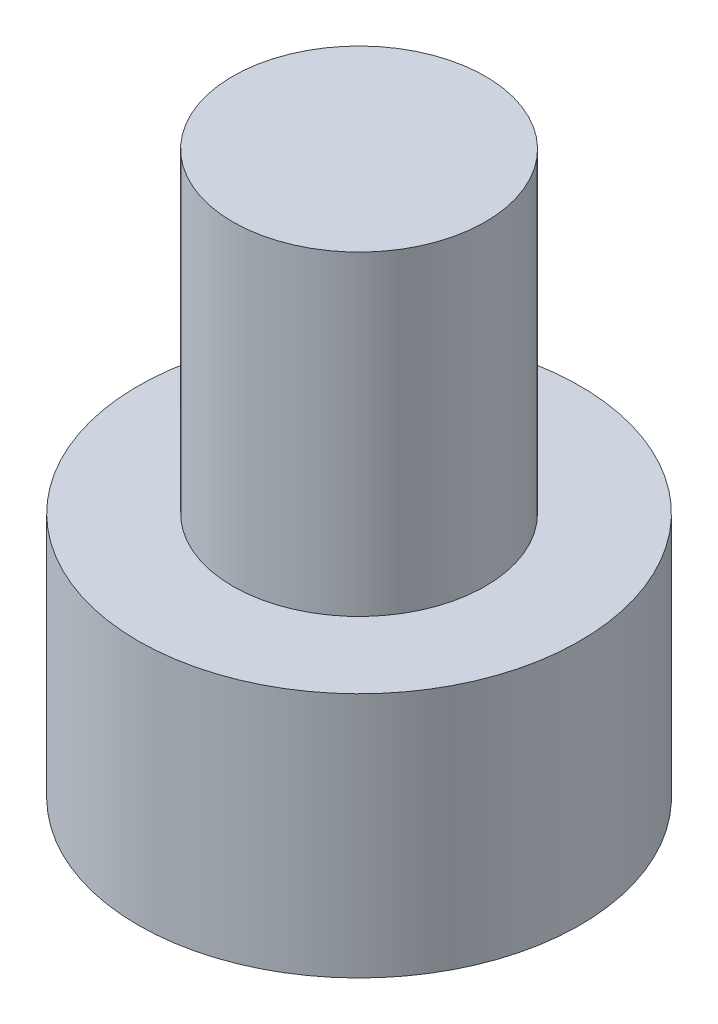
ISO-10303-21;
HEADER;
FILE_DESCRIPTION(('STEP AP214'),'2;1');
FILE_NAME('part.step','',(''),(''),'','','');
FILE_SCHEMA(('AUTOMOTIVE_DESIGN { 1 0 10303 214 1 1 1 1 }'));
ENDSEC;
DATA;
#1=APPLICATION_CONTEXT('core data for automotive mechanical design processes');
#2=APPLICATION_PROTOCOL_DEFINITION('international standard','automotive_design',2000,#1);
#3=PRODUCT_CONTEXT('',#1,'mechanical');
#4=PRODUCT('Part','Part','',(#3));
#5=PRODUCT_RELATED_PRODUCT_CATEGORY('part','',(#4));
#6=PRODUCT_DEFINITION_FORMATION('','',#4);
#7=PRODUCT_DEFINITION_CONTEXT('part definition',#1,'design');
#8=PRODUCT_DEFINITION('design','',#6,#7);
#9=PRODUCT_DEFINITION_SHAPE('','',#8);
#10=(LENGTH_UNIT() NAMED_UNIT(*) SI_UNIT(.MILLI.,.METRE.));
#11=(NAMED_UNIT(*) PLANE_ANGLE_UNIT() SI_UNIT($,.RADIAN.));
#12=(NAMED_UNIT(*) SI_UNIT($,.STERADIAN.) SOLID_ANGLE_UNIT());
#13=UNCERTAINTY_MEASURE_WITH_UNIT(LENGTH_MEASURE(1.E-05),#10,'distance_accuracy_value','');
#14=(GEOMETRIC_REPRESENTATION_CONTEXT(3) GLOBAL_UNCERTAINTY_ASSIGNED_CONTEXT((#13)) GLOBAL_UNIT_ASSIGNED_CONTEXT((#10,
#11,#12)) REPRESENTATION_CONTEXT('',''));
#15=CARTESIAN_POINT('',(0.,0.,0.));
#16=DIRECTION('',(0.,0.,1.));
#17=DIRECTION('',(1.,0.,0.));
#18=AXIS2_PLACEMENT_3D('',#15,#16,#17);
#19=CARTESIAN_POINT('',(0.,3.9,0.));
#20=DIRECTION('',(0.,-1.,0.));
#21=DIRECTION('',(0.,0.,-1.));
#22=AXIS2_PLACEMENT_3D('',#19,#20,#21);
#23=CYLINDRICAL_SURFACE('',#22,3.5);
#24=CARTESIAN_POINT('',(0.,3.9,0.));
#25=DIRECTION('',(0.,1.,0.));
#26=DIRECTION('',(0.,0.,1.));
#27=AXIS2_PLACEMENT_3D('',#24,#25,#26);
#28=CIRCLE('',#27,3.5);
#29=CARTESIAN_POINT('',(0.,3.9,3.5));
#30=VERTEX_POINT('',#29);
#31=EDGE_CURVE('E43',#30,#30,#28,.T.);
#32=ORIENTED_EDGE('',*,*,#31,.F.);
#33=EDGE_LOOP('',(#32));
#34=FACE_BOUND('',#33,.T.);
#35=CARTESIAN_POINT('',(0.,0.,0.));
#36=DIRECTION('',(0.,1.,0.));
#37=DIRECTION('',(0.,0.,1.));
#38=AXIS2_PLACEMENT_3D('',#35,#36,#37);
#39=CIRCLE('',#38,3.5);
#40=CARTESIAN_POINT('',(0.,0.,3.5));
#41=VERTEX_POINT('',#40);
#42=EDGE_CURVE('E38',#41,#41,#39,.T.);
#43=ORIENTED_EDGE('',*,*,#42,.T.);
#44=EDGE_LOOP('',(#43));
#45=FACE_BOUND('',#44,.T.);
#46=ADVANCED_FACE('F35',(#34,#45),#23,.T.);
#47=CARTESIAN_POINT('',(0.,3.9,0.));
#48=DIRECTION('',(0.,1.,0.));
#49=DIRECTION('',(0.,0.,1.));
#50=AXIS2_PLACEMENT_3D('',#47,#48,#49);
#51=PLANE('',#50);
#52=CARTESIAN_POINT('',(0.,3.9,0.));
#53=DIRECTION('',(0.,1.,0.));
#54=DIRECTION('',(0.,0.,1.));
#55=AXIS2_PLACEMENT_3D('',#52,#53,#54);
#56=CIRCLE('',#55,2.);
#57=CARTESIAN_POINT('',(0.,3.9,2.));
#58=VERTEX_POINT('',#57);
#59=EDGE_CURVE('E11',#58,#58,#56,.T.);
#60=ORIENTED_EDGE('',*,*,#59,.F.);
#61=EDGE_LOOP('',(#60));
#62=FACE_BOUND('',#61,.T.);
#63=ORIENTED_EDGE('',*,*,#31,.T.);
#64=EDGE_LOOP('',(#63));
#65=FACE_BOUND('',#64,.T.);
#66=ADVANCED_FACE('F155',(#62,#65),#51,.T.);
#67=CARTESIAN_POINT('',(0.,0.,0.));
#68=DIRECTION('',(0.,1.,0.));
#69=DIRECTION('',(0.,0.,1.));
#70=AXIS2_PLACEMENT_3D('',#67,#68,#69);
#71=PLANE('',#70);
#72=DIRECTION('',(-0.5,0.,0.866025403784438));
#73=VECTOR('',#72,1.);
#74=CARTESIAN_POINT('',(1.725,0.,0.));
#75=LINE('',#74,#73);
#76=CARTESIAN_POINT('',(1.725,0.,0.));
#77=VERTEX_POINT('',#76);
#78=CARTESIAN_POINT('',(0.862499999999999,0.,1.49389382152816));
#79=VERTEX_POINT('',#78);
#80=EDGE_CURVE('E125',#77,#79,#75,.T.);
#81=ORIENTED_EDGE('',*,*,#80,.F.);
#82=DIRECTION('',(0.5,0.,0.866025403784439));
#83=VECTOR('',#82,1.);
#84=CARTESIAN_POINT('',(0.8625,0.,-1.49389382152816));
#85=LINE('',#84,#83);
#86=CARTESIAN_POINT('',(0.8625,0.,-1.49389382152816));
#87=VERTEX_POINT('',#86);
#88=EDGE_CURVE('E51',#87,#77,#85,.T.);
#89=ORIENTED_EDGE('',*,*,#88,.F.);
#90=DIRECTION('',(1.,0.,0.));
#91=VECTOR('',#90,1.);
#92=CARTESIAN_POINT('',(-0.8625,0.,-1.49389382152816));
#93=LINE('',#92,#91);
#94=CARTESIAN_POINT('',(-0.8625,0.,-1.49389382152816));
#95=VERTEX_POINT('',#94);
#96=EDGE_CURVE('E134',#95,#87,#93,.T.);
#97=ORIENTED_EDGE('',*,*,#96,.F.);
#98=DIRECTION('',(0.5,0.,-0.866025403784439));
#99=VECTOR('',#98,1.);
#100=CARTESIAN_POINT('',(-1.725,0.,0.));
#101=LINE('',#100,#99);
#102=CARTESIAN_POINT('',(-1.725,0.,0.));
#103=VERTEX_POINT('',#102);
#104=EDGE_CURVE('E132',#103,#95,#101,.T.);
#105=ORIENTED_EDGE('',*,*,#104,.F.);
#106=DIRECTION('',(-0.5,0.,-0.866025403784439));
#107=VECTOR('',#106,1.);
#108=CARTESIAN_POINT('',(-0.8625,0.,1.49389382152816));
#109=LINE('',#108,#107);
#110=CARTESIAN_POINT('',(-0.8625,0.,1.49389382152816));
#111=VERTEX_POINT('',#110);
#112=EDGE_CURVE('E99',#111,#103,#109,.T.);
#113=ORIENTED_EDGE('',*,*,#112,.F.);
#114=DIRECTION('',(-1.,0.,0.));
#115=VECTOR('',#114,1.);
#116=CARTESIAN_POINT('',(0.862499999999999,0.,1.49389382152816));
#117=LINE('',#116,#115);
#118=EDGE_CURVE('E128',#79,#111,#117,.T.);
#119=ORIENTED_EDGE('',*,*,#118,.F.);
#120=EDGE_LOOP('',(#81,#89,#97,#105,#113,#119));
#121=FACE_BOUND('',#120,.T.);
#122=ORIENTED_EDGE('',*,*,#42,.F.);
#123=EDGE_LOOP('',(#122));
#124=FACE_BOUND('',#123,.T.);
#125=ADVANCED_FACE('F152',(#121,#124),#71,.F.);
#126=CARTESIAN_POINT('',(0.,8.9,0.));
#127=DIRECTION('',(0.,-1.,0.));
#128=DIRECTION('',(0.,0.,-1.));
#129=AXIS2_PLACEMENT_3D('',#126,#127,#128);
#130=CYLINDRICAL_SURFACE('',#129,2.);
#131=CARTESIAN_POINT('',(0.,8.9,0.));
#132=DIRECTION('',(0.,1.,0.));
#133=DIRECTION('',(0.,0.,1.));
#134=AXIS2_PLACEMENT_3D('',#131,#132,#133);
#135=CIRCLE('',#134,2.);
#136=CARTESIAN_POINT('',(0.,8.9,2.));
#137=VERTEX_POINT('',#136);
#138=EDGE_CURVE('E138',#137,#137,#135,.T.);
#139=ORIENTED_EDGE('',*,*,#138,.F.);
#140=EDGE_LOOP('',(#139));
#141=FACE_BOUND('',#140,.T.);
#142=ORIENTED_EDGE('',*,*,#59,.T.);
#143=EDGE_LOOP('',(#142));
#144=FACE_BOUND('',#143,.T.);
#145=ADVANCED_FACE('F154',(#141,#144),#130,.T.);
#146=CARTESIAN_POINT('',(0.,8.9,0.));
#147=DIRECTION('',(0.,1.,0.));
#148=DIRECTION('',(0.,0.,1.));
#149=AXIS2_PLACEMENT_3D('',#146,#147,#148);
#150=PLANE('',#149);
#151=ORIENTED_EDGE('',*,*,#138,.T.);
#152=EDGE_LOOP('',(#151));
#153=FACE_BOUND('',#152,.T.);
#154=ADVANCED_FACE('F161',(#153),#150,.T.);
#155=CARTESIAN_POINT('',(0.8625,2.4,-1.49389382152816));
#156=DIRECTION('',(0.866025403784439,0.,-0.5));
#157=DIRECTION('',(-0.5,0.,-0.866025403784439));
#158=AXIS2_PLACEMENT_3D('',#155,#156,#157);
#159=PLANE('',#158);
#160=ORIENTED_EDGE('',*,*,#88,.T.);
#161=DIRECTION('',(0.,-1.,0.));
#162=VECTOR('',#161,1.);
#163=CARTESIAN_POINT('',(1.725,2.4,0.));
#164=LINE('',#163,#162);
#165=CARTESIAN_POINT('',(1.725,2.4,0.));
#166=VERTEX_POINT('',#165);
#167=EDGE_CURVE('E81',#166,#77,#164,.T.);
#168=ORIENTED_EDGE('',*,*,#167,.F.);
#169=DIRECTION('',(0.5,0.,0.866025403784439));
#170=VECTOR('',#169,1.);
#171=CARTESIAN_POINT('',(0.8625,2.4,-1.49389382152816));
#172=LINE('',#171,#170);
#173=CARTESIAN_POINT('',(0.8625,2.4,-1.49389382152816));
#174=VERTEX_POINT('',#173);
#175=EDGE_CURVE('E136',#174,#166,#172,.T.);
#176=ORIENTED_EDGE('',*,*,#175,.F.);
#177=DIRECTION('',(0.,-1.,0.));
#178=VECTOR('',#177,1.);
#179=CARTESIAN_POINT('',(0.8625,2.4,-1.49389382152816));
#180=LINE('',#179,#178);
#181=EDGE_CURVE('E59',#174,#87,#180,.T.);
#182=ORIENTED_EDGE('',*,*,#181,.T.);
#183=EDGE_LOOP('',(#160,#168,#176,#182));
#184=FACE_BOUND('',#183,.T.);
#185=ADVANCED_FACE('F190',(#184),#159,.F.);
#186=CARTESIAN_POINT('',(-0.8625,2.4,-1.49389382152816));
#187=DIRECTION('',(0.,0.,-1.));
#188=DIRECTION('',(-1.,0.,0.));
#189=AXIS2_PLACEMENT_3D('',#186,#187,#188);
#190=PLANE('',#189);
#191=ORIENTED_EDGE('',*,*,#96,.T.);
#192=ORIENTED_EDGE('',*,*,#181,.F.);
#193=DIRECTION('',(1.,0.,0.));
#194=VECTOR('',#193,1.);
#195=CARTESIAN_POINT('',(-0.8625,2.4,-1.49389382152816));
#196=LINE('',#195,#194);
#197=CARTESIAN_POINT('',(-0.8625,2.4,-1.49389382152816));
#198=VERTEX_POINT('',#197);
#199=EDGE_CURVE('E111',#198,#174,#196,.T.);
#200=ORIENTED_EDGE('',*,*,#199,.F.);
#201=DIRECTION('',(0.,-1.,0.));
#202=VECTOR('',#201,1.);
#203=CARTESIAN_POINT('',(-0.8625,2.4,-1.49389382152816));
#204=LINE('',#203,#202);
#205=EDGE_CURVE('E103',#198,#95,#204,.T.);
#206=ORIENTED_EDGE('',*,*,#205,.T.);
#207=EDGE_LOOP('',(#191,#192,#200,#206));
#208=FACE_BOUND('',#207,.T.);
#209=ADVANCED_FACE('F204',(#208),#190,.F.);
#210=CARTESIAN_POINT('',(-1.725,2.4,0.));
#211=DIRECTION('',(-0.866025403784439,0.,-0.5));
#212=DIRECTION('',(-0.5,0.,0.866025403784439));
#213=AXIS2_PLACEMENT_3D('',#210,#211,#212);
#214=PLANE('',#213);
#215=ORIENTED_EDGE('',*,*,#104,.T.);
#216=ORIENTED_EDGE('',*,*,#205,.F.);
#217=DIRECTION('',(0.5,0.,-0.866025403784439));
#218=VECTOR('',#217,1.);
#219=CARTESIAN_POINT('',(-1.725,2.4,0.));
#220=LINE('',#219,#218);
#221=CARTESIAN_POINT('',(-1.725,2.4,0.));
#222=VERTEX_POINT('',#221);
#223=EDGE_CURVE('E107',#222,#198,#220,.T.);
#224=ORIENTED_EDGE('',*,*,#223,.F.);
#225=DIRECTION('',(0.,-1.,0.));
#226=VECTOR('',#225,1.);
#227=CARTESIAN_POINT('',(-1.725,2.4,0.));
#228=LINE('',#227,#226);
#229=EDGE_CURVE('E92',#222,#103,#228,.T.);
#230=ORIENTED_EDGE('',*,*,#229,.T.);
#231=EDGE_LOOP('',(#215,#216,#224,#230));
#232=FACE_BOUND('',#231,.T.);
#233=ADVANCED_FACE('F108',(#232),#214,.F.);
#234=CARTESIAN_POINT('',(-0.8625,2.4,1.49389382152816));
#235=DIRECTION('',(-0.866025403784439,0.,0.5));
#236=DIRECTION('',(0.5,0.,0.866025403784439));
#237=AXIS2_PLACEMENT_3D('',#234,#235,#236);
#238=PLANE('',#237);
#239=ORIENTED_EDGE('',*,*,#112,.T.);
#240=ORIENTED_EDGE('',*,*,#229,.F.);
#241=DIRECTION('',(-0.5,0.,-0.866025403784439));
#242=VECTOR('',#241,1.);
#243=CARTESIAN_POINT('',(-0.8625,2.4,1.49389382152816));
#244=LINE('',#243,#242);
#245=CARTESIAN_POINT('',(-0.8625,2.4,1.49389382152816));
#246=VERTEX_POINT('',#245);
#247=EDGE_CURVE('E96',#246,#222,#244,.T.);
#248=ORIENTED_EDGE('',*,*,#247,.F.);
#249=DIRECTION('',(0.,-1.,0.));
#250=VECTOR('',#249,1.);
#251=CARTESIAN_POINT('',(-0.8625,2.4,1.49389382152816));
#252=LINE('',#251,#250);
#253=EDGE_CURVE('E104',#246,#111,#252,.T.);
#254=ORIENTED_EDGE('',*,*,#253,.T.);
#255=EDGE_LOOP('',(#239,#240,#248,#254));
#256=FACE_BOUND('',#255,.T.);
#257=ADVANCED_FACE('F94',(#256),#238,.F.);
#258=CARTESIAN_POINT('',(0.862499999999999,2.4,1.49389382152816));
#259=DIRECTION('',(0.,0.,1.));
#260=DIRECTION('',(1.,0.,0.));
#261=AXIS2_PLACEMENT_3D('',#258,#259,#260);
#262=PLANE('',#261);
#263=ORIENTED_EDGE('',*,*,#118,.T.);
#264=ORIENTED_EDGE('',*,*,#253,.F.);
#265=DIRECTION('',(-1.,0.,0.));
#266=VECTOR('',#265,1.);
#267=CARTESIAN_POINT('',(0.862499999999999,2.4,1.49389382152816));
#268=LINE('',#267,#266);
#269=CARTESIAN_POINT('',(0.862499999999999,2.4,1.49389382152816));
#270=VERTEX_POINT('',#269);
#271=EDGE_CURVE('E117',#270,#246,#268,.T.);
#272=ORIENTED_EDGE('',*,*,#271,.F.);
#273=DIRECTION('',(0.,-1.,0.));
#274=VECTOR('',#273,1.);
#275=CARTESIAN_POINT('',(0.862499999999999,2.4,1.49389382152816));
#276=LINE('',#275,#274);
#277=EDGE_CURVE('E141',#270,#79,#276,.T.);
#278=ORIENTED_EDGE('',*,*,#277,.T.);
#279=EDGE_LOOP('',(#263,#264,#272,#278));
#280=FACE_BOUND('',#279,.T.);
#281=ADVANCED_FACE('F229',(#280),#262,.F.);
#282=CARTESIAN_POINT('',(1.725,2.4,0.));
#283=DIRECTION('',(0.866025403784439,0.,0.5));
#284=DIRECTION('',(0.5,0.,-0.866025403784439));
#285=AXIS2_PLACEMENT_3D('',#282,#283,#284);
#286=PLANE('',#285);
#287=ORIENTED_EDGE('',*,*,#80,.T.);
#288=ORIENTED_EDGE('',*,*,#277,.F.);
#289=DIRECTION('',(-0.5,0.,0.866025403784438));
#290=VECTOR('',#289,1.);
#291=CARTESIAN_POINT('',(1.725,2.4,0.));
#292=LINE('',#291,#290);
#293=EDGE_CURVE('E119',#166,#270,#292,.T.);
#294=ORIENTED_EDGE('',*,*,#293,.F.);
#295=ORIENTED_EDGE('',*,*,#167,.T.);
#296=EDGE_LOOP('',(#287,#288,#294,#295));
#297=FACE_BOUND('',#296,.T.);
#298=ADVANCED_FACE('F238',(#297),#286,.F.);
#299=CARTESIAN_POINT('',(0.,2.4,0.));
#300=DIRECTION('',(0.,-1.,0.));
#301=DIRECTION('',(0.,0.,-1.));
#302=AXIS2_PLACEMENT_3D('',#299,#300,#301);
#303=PLANE('',#302);
#304=ORIENTED_EDGE('',*,*,#175,.T.);
#305=ORIENTED_EDGE('',*,*,#293,.T.);
#306=ORIENTED_EDGE('',*,*,#271,.T.);
#307=ORIENTED_EDGE('',*,*,#247,.T.);
#308=ORIENTED_EDGE('',*,*,#223,.T.);
#309=ORIENTED_EDGE('',*,*,#199,.T.);
#310=EDGE_LOOP('',(#304,#305,#306,#307,#308,#309));
#311=FACE_BOUND('',#310,.T.);
#312=ADVANCED_FACE('F114',(#311),#303,.T.);
#313=CLOSED_SHELL('',(#46,#66,#125,#145,#154,#185,#209,#233,#257,#281,#298,#312));
#314=MANIFOLD_SOLID_BREP('B2',#313);
#315=ADVANCED_BREP_SHAPE_REPRESENTATION('',(#18,#314),#14);
#316=SHAPE_DEFINITION_REPRESENTATION(#9,#315);
ENDSEC;
END-ISO-10303-21;
